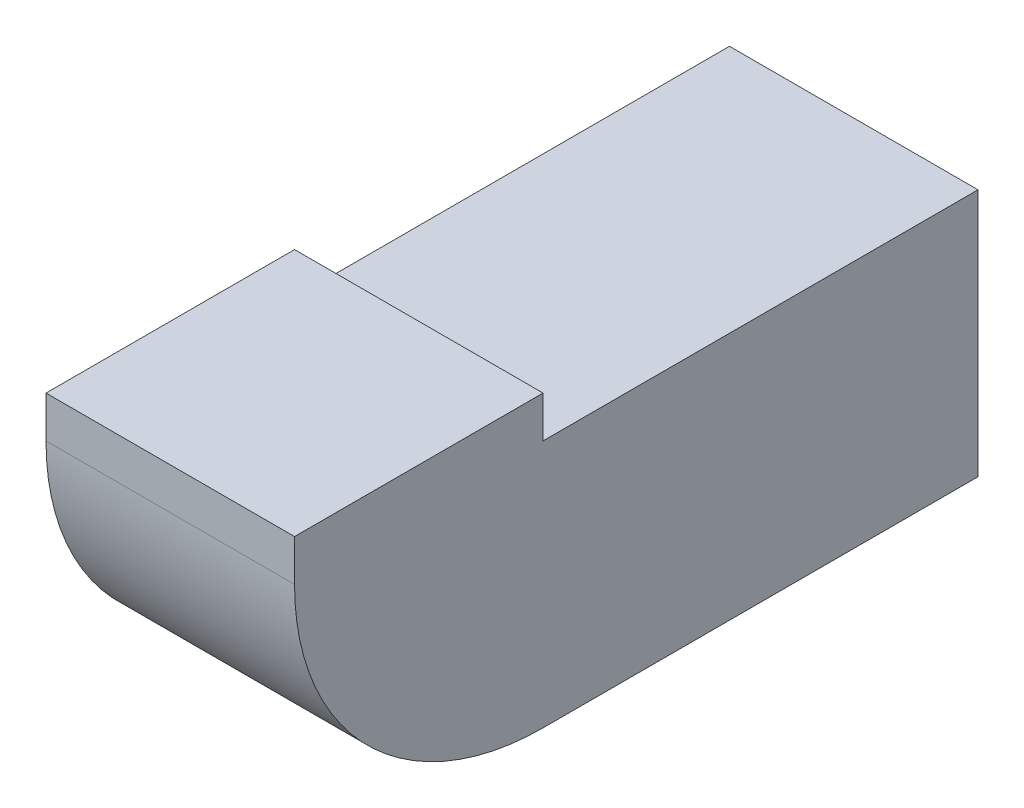
ISO-10303-21;
HEADER;
FILE_DESCRIPTION(('STEP AP214'),'2;1');
FILE_NAME('part.step','',(''),(''),'','','');
FILE_SCHEMA(('AUTOMOTIVE_DESIGN { 1 0 10303 214 1 1 1 1 }'));
ENDSEC;
DATA;
#1=APPLICATION_CONTEXT('core data for automotive mechanical design processes');
#2=APPLICATION_PROTOCOL_DEFINITION('international standard','automotive_design',2000,#1);
#3=PRODUCT_CONTEXT('',#1,'mechanical');
#4=PRODUCT('Part','Part','',(#3));
#5=PRODUCT_RELATED_PRODUCT_CATEGORY('part','',(#4));
#6=PRODUCT_DEFINITION_FORMATION('','',#4);
#7=PRODUCT_DEFINITION_CONTEXT('part definition',#1,'design');
#8=PRODUCT_DEFINITION('design','',#6,#7);
#9=PRODUCT_DEFINITION_SHAPE('','',#8);
#10=(LENGTH_UNIT() NAMED_UNIT(*) SI_UNIT(.MILLI.,.METRE.));
#11=(NAMED_UNIT(*) PLANE_ANGLE_UNIT() SI_UNIT($,.RADIAN.));
#12=(NAMED_UNIT(*) SI_UNIT($,.STERADIAN.) SOLID_ANGLE_UNIT());
#13=UNCERTAINTY_MEASURE_WITH_UNIT(LENGTH_MEASURE(1.E-05),#10,'distance_accuracy_value','');
#14=(GEOMETRIC_REPRESENTATION_CONTEXT(3) GLOBAL_UNCERTAINTY_ASSIGNED_CONTEXT((#13)) GLOBAL_UNIT_ASSIGNED_CONTEXT((#10,
#11,#12)) REPRESENTATION_CONTEXT('',''));
#15=CARTESIAN_POINT('',(0.,0.,0.));
#16=DIRECTION('',(0.,0.,1.));
#17=DIRECTION('',(1.,0.,0.));
#18=AXIS2_PLACEMENT_3D('',#15,#16,#17);
#19=CARTESIAN_POINT('',(-2.84,-0.199999999999999,0.850000000000001));
#20=DIRECTION('',(1.,0.,0.));
#21=DIRECTION('',(0.,1.,0.));
#22=AXIS2_PLACEMENT_3D('',#19,#20,#21);
#23=PLANE('',#22);
#24=DIRECTION('',(0.,0.,1.));
#25=VECTOR('',#24,1.);
#26=CARTESIAN_POINT('',(-2.84,-0.199999999999998,0.));
#27=LINE('',#26,#25);
#28=CARTESIAN_POINT('',(-2.84,-0.199999999999998,0.250000000000001));
#29=VERTEX_POINT('',#28);
#30=CARTESIAN_POINT('',(-2.84,-0.199999999999999,-0.799999999999999));
#31=VERTEX_POINT('',#30);
#32=EDGE_CURVE('E81',#29,#31,#27,.F.);
#33=ORIENTED_EDGE('',*,*,#32,.F.);
#34=CARTESIAN_POINT('',(-2.84,0.400000000000002,0.250000000000001));
#35=DIRECTION('',(1.,0.,0.));
#36=DIRECTION('',(0.,1.,0.));
#37=AXIS2_PLACEMENT_3D('',#34,#35,#36);
#38=CIRCLE('',#37,0.6);
#39=CARTESIAN_POINT('',(-2.84,0.400000000000001,0.850000000000001));
#40=VERTEX_POINT('',#39);
#41=EDGE_CURVE('E20',#40,#29,#38,.T.);
#42=ORIENTED_EDGE('',*,*,#41,.F.);
#43=DIRECTION('',(0.,1.,0.));
#44=VECTOR('',#43,1.);
#45=CARTESIAN_POINT('',(-2.84,-0.199999999999999,0.850000000000001));
#46=LINE('',#45,#44);
#47=CARTESIAN_POINT('',(-2.84,0.500000000000001,0.850000000000001));
#48=VERTEX_POINT('',#47);
#49=EDGE_CURVE('E93',#40,#48,#46,.T.);
#50=ORIENTED_EDGE('',*,*,#49,.T.);
#51=DIRECTION('',(0.,0.,1.));
#52=VECTOR('',#51,1.);
#53=CARTESIAN_POINT('',(-2.84,0.500000000000002,0.));
#54=LINE('',#53,#52);
#55=CARTESIAN_POINT('',(-2.84,0.500000000000001,0.250000000000001));
#56=VERTEX_POINT('',#55);
#57=EDGE_CURVE('E139',#48,#56,#54,.F.);
#58=ORIENTED_EDGE('',*,*,#57,.T.);
#59=DIRECTION('',(0.,1.,0.));
#60=VECTOR('',#59,1.);
#61=CARTESIAN_POINT('',(-2.84,-0.199999999999999,0.250000000000001));
#62=LINE('',#61,#60);
#63=CARTESIAN_POINT('',(-2.84,0.4,0.250000000000001));
#64=VERTEX_POINT('',#63);
#65=EDGE_CURVE('E125',#56,#64,#62,.F.);
#66=ORIENTED_EDGE('',*,*,#65,.T.);
#67=DIRECTION('',(0.,0.,-1.));
#68=VECTOR('',#67,1.);
#69=CARTESIAN_POINT('',(-2.84,0.4,-5.55));
#70=LINE('',#69,#68);
#71=CARTESIAN_POINT('',(-2.84,0.4,-0.799999999999999));
#72=VERTEX_POINT('',#71);
#73=EDGE_CURVE('E111',#64,#72,#70,.T.);
#74=ORIENTED_EDGE('',*,*,#73,.T.);
#75=DIRECTION('',(0.,1.,0.));
#76=VECTOR('',#75,1.);
#77=CARTESIAN_POINT('',(-2.84,0.5,-0.799999999999999));
#78=LINE('',#77,#76);
#79=EDGE_CURVE('E83',#72,#31,#78,.F.);
#80=ORIENTED_EDGE('',*,*,#79,.T.);
#81=EDGE_LOOP('',(#33,#42,#50,#58,#66,#74,#80));
#82=FACE_BOUND('',#81,.T.);
#83=ADVANCED_FACE('F17',(#82),#23,.F.);
#84=CARTESIAN_POINT('',(0.,-0.199999999999999,0.));
#85=DIRECTION('',(0.,-1.,0.));
#86=DIRECTION('',(1.,0.,0.));
#87=AXIS2_PLACEMENT_3D('',#84,#85,#86);
#88=PLANE('',#87);
#89=DIRECTION('',(1.,0.,0.));
#90=VECTOR('',#89,1.);
#91=CARTESIAN_POINT('',(0.,-0.199999999999999,0.250000000000001));
#92=LINE('',#91,#90);
#93=CARTESIAN_POINT('',(-2.24,-0.199999999999999,0.250000000000001));
#94=VERTEX_POINT('',#93);
#95=EDGE_CURVE('E78',#29,#94,#92,.T.);
#96=ORIENTED_EDGE('',*,*,#95,.F.);
#97=ORIENTED_EDGE('',*,*,#32,.T.);
#98=DIRECTION('',(1.,0.,0.));
#99=VECTOR('',#98,1.);
#100=CARTESIAN_POINT('',(1.5,-0.199999999999999,-0.799999999999999));
#101=LINE('',#100,#99);
#102=CARTESIAN_POINT('',(-2.24,-0.199999999999999,-0.799999999999999));
#103=VERTEX_POINT('',#102);
#104=EDGE_CURVE('E99',#31,#103,#101,.T.);
#105=ORIENTED_EDGE('',*,*,#104,.T.);
#106=DIRECTION('',(0.,0.,1.));
#107=VECTOR('',#106,1.);
#108=CARTESIAN_POINT('',(-2.24,-0.199999999999999,0.250000000000001));
#109=LINE('',#108,#107);
#110=EDGE_CURVE('E91',#103,#94,#109,.T.);
#111=ORIENTED_EDGE('',*,*,#110,.T.);
#112=EDGE_LOOP('',(#96,#97,#105,#111));
#113=FACE_BOUND('',#112,.T.);
#114=ADVANCED_FACE('F89',(#113),#88,.T.);
#115=CARTESIAN_POINT('',(0.,0.400000000000001,0.250000000000001));
#116=DIRECTION('',(1.,0.,0.));
#117=DIRECTION('',(0.,1.,0.));
#118=AXIS2_PLACEMENT_3D('',#115,#116,#117);
#119=CYLINDRICAL_SURFACE('',#118,0.6);
#120=ORIENTED_EDGE('',*,*,#41,.T.);
#121=ORIENTED_EDGE('',*,*,#95,.T.);
#122=CARTESIAN_POINT('',(-2.24,0.400000000000001,0.250000000000001));
#123=DIRECTION('',(1.,0.,0.));
#124=DIRECTION('',(0.,1.,0.));
#125=AXIS2_PLACEMENT_3D('',#122,#123,#124);
#126=CIRCLE('',#125,0.6);
#127=CARTESIAN_POINT('',(-2.24,0.400000000000001,0.850000000000001));
#128=VERTEX_POINT('',#127);
#129=EDGE_CURVE('E148',#94,#128,#126,.F.);
#130=ORIENTED_EDGE('',*,*,#129,.T.);
#131=DIRECTION('',(-1.,0.,0.));
#132=VECTOR('',#131,1.);
#133=CARTESIAN_POINT('',(-2.24,0.400000000000001,0.850000000000001));
#134=LINE('',#133,#132);
#135=EDGE_CURVE('E80',#128,#40,#134,.T.);
#136=ORIENTED_EDGE('',*,*,#135,.T.);
#137=EDGE_LOOP('',(#120,#121,#130,#136));
#138=FACE_BOUND('',#137,.T.);
#139=ADVANCED_FACE('F75',(#138),#119,.T.);
#140=CARTESIAN_POINT('',(-2.24,-0.199999999999999,0.850000000000001));
#141=DIRECTION('',(0.,0.,-1.));
#142=DIRECTION('',(-1.,0.,0.));
#143=AXIS2_PLACEMENT_3D('',#140,#141,#142);
#144=PLANE('',#143);
#145=ORIENTED_EDGE('',*,*,#135,.F.);
#146=DIRECTION('',(0.,-1.,0.));
#147=VECTOR('',#146,1.);
#148=CARTESIAN_POINT('',(-2.24,-0.199999999999999,0.850000000000001));
#149=LINE('',#148,#147);
#150=CARTESIAN_POINT('',(-2.24,0.500000000000001,0.850000000000001));
#151=VERTEX_POINT('',#150);
#152=EDGE_CURVE('E149',#128,#151,#149,.F.);
#153=ORIENTED_EDGE('',*,*,#152,.T.);
#154=DIRECTION('',(1.,0.,0.));
#155=VECTOR('',#154,1.);
#156=CARTESIAN_POINT('',(0.,0.500000000000001,0.850000000000001));
#157=LINE('',#156,#155);
#158=EDGE_CURVE('E143',#151,#48,#157,.F.);
#159=ORIENTED_EDGE('',*,*,#158,.T.);
#160=ORIENTED_EDGE('',*,*,#49,.F.);
#161=EDGE_LOOP('',(#145,#153,#159,#160));
#162=FACE_BOUND('',#161,.T.);
#163=ADVANCED_FACE('F163',(#162),#144,.F.);
#164=CARTESIAN_POINT('',(0.,0.500000000000001,0.));
#165=DIRECTION('',(0.,-1.,0.));
#166=DIRECTION('',(1.,0.,0.));
#167=AXIS2_PLACEMENT_3D('',#164,#165,#166);
#168=PLANE('',#167);
#169=ORIENTED_EDGE('',*,*,#158,.F.);
#170=DIRECTION('',(0.,0.,1.));
#171=VECTOR('',#170,1.);
#172=CARTESIAN_POINT('',(-2.24,0.500000000000001,0.250000000000001));
#173=LINE('',#172,#171);
#174=CARTESIAN_POINT('',(-2.24,0.500000000000001,0.250000000000001));
#175=VERTEX_POINT('',#174);
#176=EDGE_CURVE('E134',#151,#175,#173,.F.);
#177=ORIENTED_EDGE('',*,*,#176,.T.);
#178=DIRECTION('',(1.,0.,0.));
#179=VECTOR('',#178,1.);
#180=CARTESIAN_POINT('',(-2.84,0.500000000000001,0.250000000000001));
#181=LINE('',#180,#179);
#182=EDGE_CURVE('E129',#175,#56,#181,.F.);
#183=ORIENTED_EDGE('',*,*,#182,.T.);
#184=ORIENTED_EDGE('',*,*,#57,.F.);
#185=EDGE_LOOP('',(#169,#177,#183,#184));
#186=FACE_BOUND('',#185,.T.);
#187=ADVANCED_FACE('F168',(#186),#168,.F.);
#188=CARTESIAN_POINT('',(-2.84,-0.199999999999999,0.250000000000001));
#189=DIRECTION('',(0.,0.,1.));
#190=DIRECTION('',(1.,0.,0.));
#191=AXIS2_PLACEMENT_3D('',#188,#189,#190);
#192=PLANE('',#191);
#193=ORIENTED_EDGE('',*,*,#65,.F.);
#194=ORIENTED_EDGE('',*,*,#182,.F.);
#195=DIRECTION('',(0.,-1.,0.));
#196=VECTOR('',#195,1.);
#197=CARTESIAN_POINT('',(-2.24,-0.199999999999999,0.250000000000001));
#198=LINE('',#197,#196);
#199=CARTESIAN_POINT('',(-2.24,0.4,0.250000000000001));
#200=VERTEX_POINT('',#199);
#201=EDGE_CURVE('E120',#175,#200,#198,.T.);
#202=ORIENTED_EDGE('',*,*,#201,.T.);
#203=DIRECTION('',(1.,0.,0.));
#204=VECTOR('',#203,1.);
#205=CARTESIAN_POINT('',(-2.24,0.4,0.250000000000001));
#206=LINE('',#205,#204);
#207=EDGE_CURVE('E115',#200,#64,#206,.F.);
#208=ORIENTED_EDGE('',*,*,#207,.T.);
#209=EDGE_LOOP('',(#193,#194,#202,#208));
#210=FACE_BOUND('',#209,.T.);
#211=ADVANCED_FACE('F175',(#210),#192,.F.);
#212=CARTESIAN_POINT('',(-2.24,0.4,-5.55));
#213=DIRECTION('',(0.,-1.,0.));
#214=DIRECTION('',(0.,0.,-1.));
#215=AXIS2_PLACEMENT_3D('',#212,#213,#214);
#216=PLANE('',#215);
#217=ORIENTED_EDGE('',*,*,#73,.F.);
#218=ORIENTED_EDGE('',*,*,#207,.F.);
#219=DIRECTION('',(0.,0.,1.));
#220=VECTOR('',#219,1.);
#221=CARTESIAN_POINT('',(-2.24,0.4,0.250000000000001));
#222=LINE('',#221,#220);
#223=CARTESIAN_POINT('',(-2.24,0.4,-0.799999999999999));
#224=VERTEX_POINT('',#223);
#225=EDGE_CURVE('E26',#200,#224,#222,.F.);
#226=ORIENTED_EDGE('',*,*,#225,.T.);
#227=DIRECTION('',(1.,0.,0.));
#228=VECTOR('',#227,1.);
#229=CARTESIAN_POINT('',(1.5,0.4,-0.799999999999999));
#230=LINE('',#229,#228);
#231=EDGE_CURVE('E34',#224,#72,#230,.F.);
#232=ORIENTED_EDGE('',*,*,#231,.T.);
#233=EDGE_LOOP('',(#217,#218,#226,#232));
#234=FACE_BOUND('',#233,.T.);
#235=ADVANCED_FACE('F178',(#234),#216,.F.);
#236=CARTESIAN_POINT('',(1.5,0.5,-0.799999999999999));
#237=DIRECTION('',(0.,0.,1.));
#238=DIRECTION('',(1.,0.,0.));
#239=AXIS2_PLACEMENT_3D('',#236,#237,#238);
#240=PLANE('',#239);
#241=ORIENTED_EDGE('',*,*,#104,.F.);
#242=ORIENTED_EDGE('',*,*,#79,.F.);
#243=ORIENTED_EDGE('',*,*,#231,.F.);
#244=DIRECTION('',(0.,-1.,0.));
#245=VECTOR('',#244,1.);
#246=CARTESIAN_POINT('',(-2.24,-0.199999999999999,-0.799999999999999));
#247=LINE('',#246,#245);
#248=EDGE_CURVE('E11',#224,#103,#247,.T.);
#249=ORIENTED_EDGE('',*,*,#248,.T.);
#250=EDGE_LOOP('',(#241,#242,#243,#249));
#251=FACE_BOUND('',#250,.T.);
#252=ADVANCED_FACE('F180',(#251),#240,.F.);
#253=CARTESIAN_POINT('',(-2.24,-0.199999999999999,0.250000000000001));
#254=DIRECTION('',(-1.,0.,0.));
#255=DIRECTION('',(0.,-1.,0.));
#256=AXIS2_PLACEMENT_3D('',#253,#254,#255);
#257=PLANE('',#256);
#258=ORIENTED_EDGE('',*,*,#225,.F.);
#259=ORIENTED_EDGE('',*,*,#201,.F.);
#260=ORIENTED_EDGE('',*,*,#176,.F.);
#261=ORIENTED_EDGE('',*,*,#152,.F.);
#262=ORIENTED_EDGE('',*,*,#129,.F.);
#263=ORIENTED_EDGE('',*,*,#110,.F.);
#264=ORIENTED_EDGE('',*,*,#248,.F.);
#265=EDGE_LOOP('',(#258,#259,#260,#261,#262,#263,#264));
#266=FACE_BOUND('',#265,.T.);
#267=ADVANCED_FACE('F172',(#266),#257,.F.);
#268=CLOSED_SHELL('',(#83,#114,#139,#163,#187,#211,#235,#252,#267));
#269=MANIFOLD_SOLID_BREP('B1',#268);
#270=ADVANCED_BREP_SHAPE_REPRESENTATION('',(#18,#269),#14);
#271=SHAPE_DEFINITION_REPRESENTATION(#9,#270);
ENDSEC;
END-ISO-10303-21;
